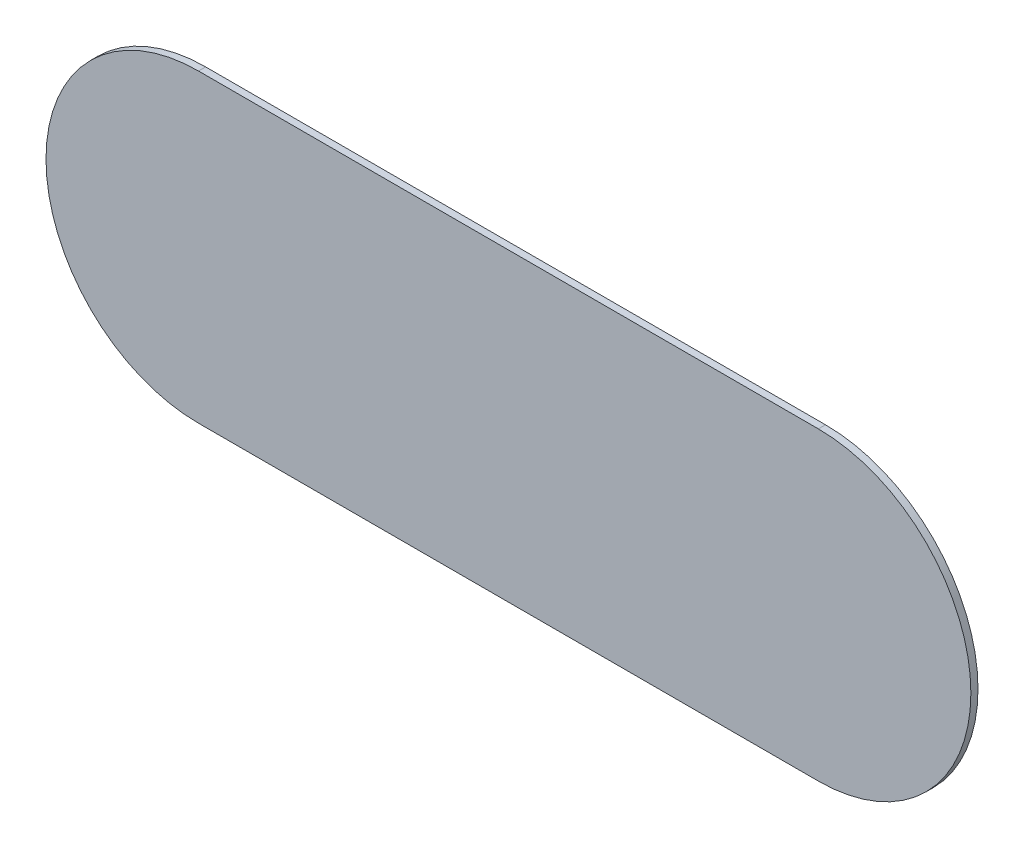
ISO-10303-21;
HEADER;
FILE_DESCRIPTION(('STEP AP214'),'2;1');
FILE_NAME('part.step','',(''),(''),'','','');
FILE_SCHEMA(('AUTOMOTIVE_DESIGN { 1 0 10303 214 1 1 1 1 }'));
ENDSEC;
DATA;
#1=APPLICATION_CONTEXT('core data for automotive mechanical design processes');
#2=APPLICATION_PROTOCOL_DEFINITION('international standard','automotive_design',2000,#1);
#3=PRODUCT_CONTEXT('',#1,'mechanical');
#4=PRODUCT('Part','Part','',(#3));
#5=PRODUCT_RELATED_PRODUCT_CATEGORY('part','',(#4));
#6=PRODUCT_DEFINITION_FORMATION('','',#4);
#7=PRODUCT_DEFINITION_CONTEXT('part definition',#1,'design');
#8=PRODUCT_DEFINITION('design','',#6,#7);
#9=PRODUCT_DEFINITION_SHAPE('','',#8);
#10=(LENGTH_UNIT() NAMED_UNIT(*) SI_UNIT(.MILLI.,.METRE.));
#11=(NAMED_UNIT(*) PLANE_ANGLE_UNIT() SI_UNIT($,.RADIAN.));
#12=(NAMED_UNIT(*) SI_UNIT($,.STERADIAN.) SOLID_ANGLE_UNIT());
#13=UNCERTAINTY_MEASURE_WITH_UNIT(LENGTH_MEASURE(1.E-05),#10,'distance_accuracy_value','');
#14=(GEOMETRIC_REPRESENTATION_CONTEXT(3) GLOBAL_UNCERTAINTY_ASSIGNED_CONTEXT((#13)) GLOBAL_UNIT_ASSIGNED_CONTEXT((#10,
#11,#12)) REPRESENTATION_CONTEXT('',''));
#15=CARTESIAN_POINT('',(0.,0.,0.));
#16=DIRECTION('',(0.,0.,1.));
#17=DIRECTION('',(1.,0.,0.));
#18=AXIS2_PLACEMENT_3D('',#15,#16,#17);
#19=CARTESIAN_POINT('',(157.988,-145.046,0.));
#20=DIRECTION('',(0.,0.,1.));
#21=DIRECTION('',(1.,0.,0.));
#22=AXIS2_PLACEMENT_3D('',#19,#20,#21);
#23=PLANE('',#22);
#24=DIRECTION('',(-1.,0.,0.));
#25=VECTOR('',#24,1.);
#26=CARTESIAN_POINT('',(157.988,-145.046,0.));
#27=LINE('',#26,#25);
#28=CARTESIAN_POINT('',(157.988,-145.046,0.));
#29=VERTEX_POINT('',#28);
#30=CARTESIAN_POINT('',(154.94,-145.046,0.));
#31=VERTEX_POINT('',#30);
#32=EDGE_CURVE('E77',#29,#31,#27,.T.);
#33=ORIENTED_EDGE('',*,*,#32,.T.);
#34=CARTESIAN_POINT('',(154.94,-145.796,0.));
#35=DIRECTION('',(0.,0.,1.));
#36=DIRECTION('',(0.,1.,0.));
#37=AXIS2_PLACEMENT_3D('',#34,#35,#36);
#38=CIRCLE('',#37,0.75);
#39=CARTESIAN_POINT('',(154.94,-146.546,0.));
#40=VERTEX_POINT('',#39);
#41=EDGE_CURVE('E75',#31,#40,#38,.T.);
#42=ORIENTED_EDGE('',*,*,#41,.T.);
#43=DIRECTION('',(1.,0.,0.));
#44=VECTOR('',#43,1.);
#45=CARTESIAN_POINT('',(154.94,-146.546,0.));
#46=LINE('',#45,#44);
#47=CARTESIAN_POINT('',(157.988,-146.546,0.));
#48=VERTEX_POINT('',#47);
#49=EDGE_CURVE('E63',#40,#48,#46,.T.);
#50=ORIENTED_EDGE('',*,*,#49,.T.);
#51=CARTESIAN_POINT('',(157.988,-145.796,0.));
#52=DIRECTION('',(0.,0.,1.));
#53=DIRECTION('',(0.,-1.,0.));
#54=AXIS2_PLACEMENT_3D('',#51,#52,#53);
#55=CIRCLE('',#54,0.75);
#56=EDGE_CURVE('E11',#48,#29,#55,.T.);
#57=ORIENTED_EDGE('',*,*,#56,.T.);
#58=EDGE_LOOP('',(#33,#42,#50,#57));
#59=FACE_BOUND('',#58,.T.);
#60=ADVANCED_FACE('F17',(#59),#23,.T.);
#61=CARTESIAN_POINT('',(157.988,-145.046,-0.035));
#62=DIRECTION('',(0.,0.,1.));
#63=DIRECTION('',(1.,0.,0.));
#64=AXIS2_PLACEMENT_3D('',#61,#62,#63);
#65=PLANE('',#64);
#66=CARTESIAN_POINT('',(157.988,-145.796,-0.035));
#67=DIRECTION('',(0.,0.,1.));
#68=DIRECTION('',(0.,-1.,0.));
#69=AXIS2_PLACEMENT_3D('',#66,#67,#68);
#70=CIRCLE('',#69,0.75);
#71=CARTESIAN_POINT('',(157.988,-146.546,-0.035));
#72=VERTEX_POINT('',#71);
#73=CARTESIAN_POINT('',(157.988,-145.046,-0.035));
#74=VERTEX_POINT('',#73);
#75=EDGE_CURVE('E26',#72,#74,#70,.T.);
#76=ORIENTED_EDGE('',*,*,#75,.F.);
#77=DIRECTION('',(1.,0.,0.));
#78=VECTOR('',#77,1.);
#79=CARTESIAN_POINT('',(154.94,-146.546,-0.035));
#80=LINE('',#79,#78);
#81=CARTESIAN_POINT('',(154.94,-146.546,-0.035));
#82=VERTEX_POINT('',#81);
#83=EDGE_CURVE('E82',#82,#72,#80,.T.);
#84=ORIENTED_EDGE('',*,*,#83,.F.);
#85=CARTESIAN_POINT('',(154.94,-145.796,-0.035));
#86=DIRECTION('',(0.,0.,1.));
#87=DIRECTION('',(0.,1.,0.));
#88=AXIS2_PLACEMENT_3D('',#85,#86,#87);
#89=CIRCLE('',#88,0.75);
#90=CARTESIAN_POINT('',(154.94,-145.046,-0.035));
#91=VERTEX_POINT('',#90);
#92=EDGE_CURVE('E85',#91,#82,#89,.T.);
#93=ORIENTED_EDGE('',*,*,#92,.F.);
#94=DIRECTION('',(-1.,0.,0.));
#95=VECTOR('',#94,1.);
#96=CARTESIAN_POINT('',(157.988,-145.046,-0.035));
#97=LINE('',#96,#95);
#98=EDGE_CURVE('E109',#74,#91,#97,.T.);
#99=ORIENTED_EDGE('',*,*,#98,.F.);
#100=EDGE_LOOP('',(#76,#84,#93,#99));
#101=FACE_BOUND('',#100,.T.);
#102=ADVANCED_FACE('F111',(#101),#65,.F.);
#103=CARTESIAN_POINT('',(157.988,-145.796,-0.035));
#104=DIRECTION('',(0.,0.,-1.));
#105=DIRECTION('',(0.,-1.,0.));
#106=AXIS2_PLACEMENT_3D('',#103,#104,#105);
#107=CYLINDRICAL_SURFACE('',#106,0.75);
#108=ORIENTED_EDGE('',*,*,#75,.T.);
#109=DIRECTION('',(0.,0.,1.));
#110=VECTOR('',#109,1.);
#111=CARTESIAN_POINT('',(157.988,-145.046,-0.035));
#112=LINE('',#111,#110);
#113=EDGE_CURVE('E92',#74,#29,#112,.T.);
#114=ORIENTED_EDGE('',*,*,#113,.T.);
#115=ORIENTED_EDGE('',*,*,#56,.F.);
#116=DIRECTION('',(0.,0.,1.));
#117=VECTOR('',#116,1.);
#118=CARTESIAN_POINT('',(157.988,-146.546,-0.035));
#119=LINE('',#118,#117);
#120=EDGE_CURVE('E70',#72,#48,#119,.T.);
#121=ORIENTED_EDGE('',*,*,#120,.F.);
#122=EDGE_LOOP('',(#108,#114,#115,#121));
#123=FACE_BOUND('',#122,.T.);
#124=ADVANCED_FACE('F103',(#123),#107,.T.);
#125=CARTESIAN_POINT('',(154.94,-146.546,-0.035));
#126=DIRECTION('',(0.,1.,0.));
#127=DIRECTION('',(1.,0.,0.));
#128=AXIS2_PLACEMENT_3D('',#125,#126,#127);
#129=PLANE('',#128);
#130=ORIENTED_EDGE('',*,*,#83,.T.);
#131=ORIENTED_EDGE('',*,*,#120,.T.);
#132=ORIENTED_EDGE('',*,*,#49,.F.);
#133=DIRECTION('',(0.,0.,1.));
#134=VECTOR('',#133,1.);
#135=CARTESIAN_POINT('',(154.94,-146.546,-0.035));
#136=LINE('',#135,#134);
#137=EDGE_CURVE('E68',#82,#40,#136,.T.);
#138=ORIENTED_EDGE('',*,*,#137,.F.);
#139=EDGE_LOOP('',(#130,#131,#132,#138));
#140=FACE_BOUND('',#139,.T.);
#141=ADVANCED_FACE('F66',(#140),#129,.F.);
#142=CARTESIAN_POINT('',(154.94,-145.796,-0.035));
#143=DIRECTION('',(0.,0.,-1.));
#144=DIRECTION('',(0.,1.,0.));
#145=AXIS2_PLACEMENT_3D('',#142,#143,#144);
#146=CYLINDRICAL_SURFACE('',#145,0.75);
#147=ORIENTED_EDGE('',*,*,#92,.T.);
#148=ORIENTED_EDGE('',*,*,#137,.T.);
#149=ORIENTED_EDGE('',*,*,#41,.F.);
#150=DIRECTION('',(0.,0.,1.));
#151=VECTOR('',#150,1.);
#152=CARTESIAN_POINT('',(154.94,-145.046,-0.035));
#153=LINE('',#152,#151);
#154=EDGE_CURVE('E113',#91,#31,#153,.T.);
#155=ORIENTED_EDGE('',*,*,#154,.F.);
#156=EDGE_LOOP('',(#147,#148,#149,#155));
#157=FACE_BOUND('',#156,.T.);
#158=ADVANCED_FACE('F84',(#157),#146,.T.);
#159=CARTESIAN_POINT('',(157.988,-145.046,-0.035));
#160=DIRECTION('',(0.,-1.,0.));
#161=DIRECTION('',(0.,0.,-1.));
#162=AXIS2_PLACEMENT_3D('',#159,#160,#161);
#163=PLANE('',#162);
#164=ORIENTED_EDGE('',*,*,#98,.T.);
#165=ORIENTED_EDGE('',*,*,#154,.T.);
#166=ORIENTED_EDGE('',*,*,#32,.F.);
#167=ORIENTED_EDGE('',*,*,#113,.F.);
#168=EDGE_LOOP('',(#164,#165,#166,#167));
#169=FACE_BOUND('',#168,.T.);
#170=ADVANCED_FACE('F108',(#169),#163,.F.);
#171=CLOSED_SHELL('',(#60,#102,#124,#141,#158,#170));
#172=MANIFOLD_SOLID_BREP('B1',#171);
#173=ADVANCED_BREP_SHAPE_REPRESENTATION('',(#18,#172),#14);
#174=SHAPE_DEFINITION_REPRESENTATION(#9,#173);
ENDSEC;
END-ISO-10303-21;
